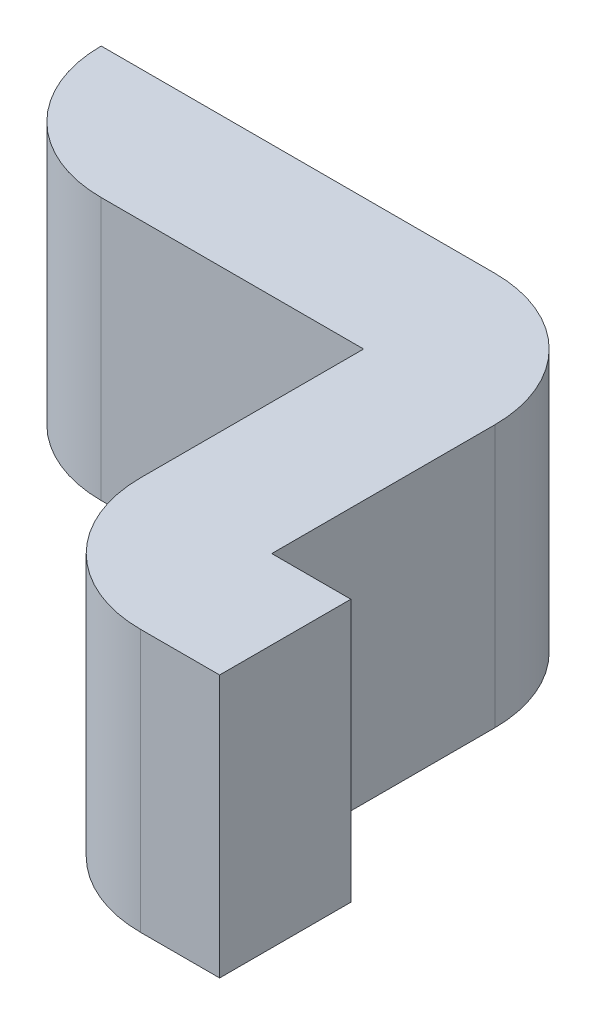
ISO-10303-21;
HEADER;
FILE_DESCRIPTION(('STEP AP214'),'2;1');
FILE_NAME('part.step','',(''),(''),'','','');
FILE_SCHEMA(('AUTOMOTIVE_DESIGN { 1 0 10303 214 1 1 1 1 }'));
ENDSEC;
DATA;
#1=APPLICATION_CONTEXT('core data for automotive mechanical design processes');
#2=APPLICATION_PROTOCOL_DEFINITION('international standard','automotive_design',2000,#1);
#3=PRODUCT_CONTEXT('',#1,'mechanical');
#4=PRODUCT('Part','Part','',(#3));
#5=PRODUCT_RELATED_PRODUCT_CATEGORY('part','',(#4));
#6=PRODUCT_DEFINITION_FORMATION('','',#4);
#7=PRODUCT_DEFINITION_CONTEXT('part definition',#1,'design');
#8=PRODUCT_DEFINITION('design','',#6,#7);
#9=PRODUCT_DEFINITION_SHAPE('','',#8);
#10=(LENGTH_UNIT() NAMED_UNIT(*) SI_UNIT(.MILLI.,.METRE.));
#11=(NAMED_UNIT(*) PLANE_ANGLE_UNIT() SI_UNIT($,.RADIAN.));
#12=(NAMED_UNIT(*) SI_UNIT($,.STERADIAN.) SOLID_ANGLE_UNIT());
#13=UNCERTAINTY_MEASURE_WITH_UNIT(LENGTH_MEASURE(1.E-05),#10,'distance_accuracy_value','');
#14=(GEOMETRIC_REPRESENTATION_CONTEXT(3) GLOBAL_UNCERTAINTY_ASSIGNED_CONTEXT((#13)) GLOBAL_UNIT_ASSIGNED_CONTEXT((#10,
#11,#12)) REPRESENTATION_CONTEXT('',''));
#15=CARTESIAN_POINT('',(0.,0.,0.));
#16=DIRECTION('',(0.,0.,1.));
#17=DIRECTION('',(1.,0.,0.));
#18=AXIS2_PLACEMENT_3D('',#15,#16,#17);
#19=CARTESIAN_POINT('',(-0.0635,1.2954,0.));
#20=DIRECTION('',(0.,-1.,0.));
#21=DIRECTION('',(0.,0.,-1.));
#22=AXIS2_PLACEMENT_3D('',#19,#20,#21);
#23=PLANE('',#22);
#24=DIRECTION('',(-1.,0.,0.));
#25=VECTOR('',#24,1.);
#26=CARTESIAN_POINT('',(0.0635,1.2954,0.127));
#27=LINE('',#26,#25);
#28=CARTESIAN_POINT('',(0.0635,1.2954,0.127));
#29=VERTEX_POINT('',#28);
#30=CARTESIAN_POINT('',(0.3175,1.2954,0.127));
#31=VERTEX_POINT('',#30);
#32=EDGE_CURVE('E102',#29,#31,#27,.F.);
#33=ORIENTED_EDGE('',*,*,#32,.T.);
#34=DIRECTION('',(0.,0.,-1.));
#35=VECTOR('',#34,1.);
#36=CARTESIAN_POINT('',(0.3175,1.2954,0.127));
#37=LINE('',#36,#35);
#38=CARTESIAN_POINT('',(0.3175,1.2954,0.3429));
#39=VERTEX_POINT('',#38);
#40=EDGE_CURVE('E105',#31,#39,#37,.F.);
#41=ORIENTED_EDGE('',*,*,#40,.T.);
#42=CARTESIAN_POINT('',(0.4445,1.2954,0.3429));
#43=DIRECTION('',(0.,-1.,0.));
#44=DIRECTION('',(0.,0.,-1.));
#45=AXIS2_PLACEMENT_3D('',#42,#43,#44);
#46=CIRCLE('',#45,0.127);
#47=CARTESIAN_POINT('',(0.4445,1.2954,0.4699));
#48=VERTEX_POINT('',#47);
#49=EDGE_CURVE('E117',#48,#39,#46,.T.);
#50=ORIENTED_EDGE('',*,*,#49,.F.);
#51=DIRECTION('',(-1.,0.,0.));
#52=VECTOR('',#51,1.);
#53=CARTESIAN_POINT('',(0.4445,1.2954,0.4699));
#54=LINE('',#53,#52);
#55=CARTESIAN_POINT('',(0.521041119299,1.2954,0.4699));
#56=VERTEX_POINT('',#55);
#57=EDGE_CURVE('E134',#48,#56,#54,.F.);
#58=ORIENTED_EDGE('',*,*,#57,.T.);
#59=DIRECTION('',(0.,0.,1.));
#60=VECTOR('',#59,1.);
#61=CARTESIAN_POINT('',(0.521041119299,1.2954,0.4699));
#62=LINE('',#61,#60);
#63=CARTESIAN_POINT('',(0.521041119299,1.2954,0.3429));
#64=VERTEX_POINT('',#63);
#65=EDGE_CURVE('E90',#56,#64,#62,.F.);
#66=ORIENTED_EDGE('',*,*,#65,.T.);
#67=DIRECTION('',(1.,0.,0.));
#68=VECTOR('',#67,1.);
#69=CARTESIAN_POINT('',(0.521041119299,1.2954,0.3429));
#70=LINE('',#69,#68);
#71=CARTESIAN_POINT('',(0.4445,1.2954,0.3429));
#72=VERTEX_POINT('',#71);
#73=EDGE_CURVE('E87',#64,#72,#70,.F.);
#74=ORIENTED_EDGE('',*,*,#73,.T.);
#75=DIRECTION('',(0.,0.,1.));
#76=VECTOR('',#75,1.);
#77=CARTESIAN_POINT('',(0.4445,1.2954,0.3429));
#78=LINE('',#77,#76);
#79=CARTESIAN_POINT('',(0.4445,1.2954,0.127));
#80=VERTEX_POINT('',#79);
#81=EDGE_CURVE('E82',#72,#80,#78,.F.);
#82=ORIENTED_EDGE('',*,*,#81,.T.);
#83=CARTESIAN_POINT('',(0.3175,1.2954,0.127));
#84=DIRECTION('',(0.,-1.,0.));
#85=DIRECTION('',(0.,0.,-1.));
#86=AXIS2_PLACEMENT_3D('',#83,#84,#85);
#87=CIRCLE('',#86,0.127);
#88=CARTESIAN_POINT('',(0.3175,1.2954,0.));
#89=VERTEX_POINT('',#88);
#90=EDGE_CURVE('E20',#89,#80,#87,.T.);
#91=ORIENTED_EDGE('',*,*,#90,.F.);
#92=DIRECTION('',(1.,0.,0.));
#93=VECTOR('',#92,1.);
#94=CARTESIAN_POINT('',(0.3175,1.2954,0.));
#95=LINE('',#94,#93);
#96=CARTESIAN_POINT('',(-0.0635,1.2954,0.));
#97=VERTEX_POINT('',#96);
#98=EDGE_CURVE('E76',#89,#97,#95,.F.);
#99=ORIENTED_EDGE('',*,*,#98,.T.);
#100=CARTESIAN_POINT('',(0.0635,1.2954,0.));
#101=DIRECTION('',(0.,-1.,0.));
#102=DIRECTION('',(0.,0.,-1.));
#103=AXIS2_PLACEMENT_3D('',#100,#101,#102);
#104=CIRCLE('',#103,0.127);
#105=EDGE_CURVE('E108',#29,#97,#104,.T.);
#106=ORIENTED_EDGE('',*,*,#105,.F.);
#107=EDGE_LOOP('',(#33,#41,#50,#58,#66,#74,#82,#91,#99,#106));
#108=FACE_BOUND('',#107,.T.);
#109=ADVANCED_FACE('F17',(#108),#23,.F.);
#110=CARTESIAN_POINT('',(0.3175,1.0414,0.));
#111=DIRECTION('',(0.,0.,1.));
#112=DIRECTION('',(1.,0.,0.));
#113=AXIS2_PLACEMENT_3D('',#110,#111,#112);
#114=PLANE('',#113);
#115=DIRECTION('',(0.,-1.,0.));
#116=VECTOR('',#115,1.);
#117=CARTESIAN_POINT('',(-0.0635,1.0414,0.));
#118=LINE('',#117,#116);
#119=CARTESIAN_POINT('',(-0.0635,1.0414,0.));
#120=VERTEX_POINT('',#119);
#121=EDGE_CURVE('E187',#97,#120,#118,.T.);
#122=ORIENTED_EDGE('',*,*,#121,.F.);
#123=ORIENTED_EDGE('',*,*,#98,.F.);
#124=DIRECTION('',(0.,-1.,0.));
#125=VECTOR('',#124,1.);
#126=CARTESIAN_POINT('',(0.3175,1.0414,0.));
#127=LINE('',#126,#125);
#128=CARTESIAN_POINT('',(0.3175,1.0414,0.));
#129=VERTEX_POINT('',#128);
#130=EDGE_CURVE('E159',#129,#89,#127,.F.);
#131=ORIENTED_EDGE('',*,*,#130,.F.);
#132=DIRECTION('',(1.,0.,0.));
#133=VECTOR('',#132,1.);
#134=CARTESIAN_POINT('',(-0.0635,1.0414,0.));
#135=LINE('',#134,#133);
#136=EDGE_CURVE('E186',#120,#129,#135,.T.);
#137=ORIENTED_EDGE('',*,*,#136,.F.);
#138=EDGE_LOOP('',(#122,#123,#131,#137));
#139=FACE_BOUND('',#138,.T.);
#140=ADVANCED_FACE('F217',(#139),#114,.F.);
#141=CARTESIAN_POINT('',(0.3175,1.0414,0.127));
#142=DIRECTION('',(0.,-1.,0.));
#143=DIRECTION('',(0.,0.,-1.));
#144=AXIS2_PLACEMENT_3D('',#141,#142,#143);
#145=CYLINDRICAL_SURFACE('',#144,0.127);
#146=ORIENTED_EDGE('',*,*,#90,.T.);
#147=DIRECTION('',(0.,1.,0.));
#148=VECTOR('',#147,1.);
#149=CARTESIAN_POINT('',(0.4445,1.0414,0.127));
#150=LINE('',#149,#148);
#151=CARTESIAN_POINT('',(0.4445,1.0414,0.127));
#152=VERTEX_POINT('',#151);
#153=EDGE_CURVE('E157',#80,#152,#150,.F.);
#154=ORIENTED_EDGE('',*,*,#153,.T.);
#155=CARTESIAN_POINT('',(0.3175,1.0414,0.127));
#156=DIRECTION('',(0.,-1.,0.));
#157=DIRECTION('',(0.,0.,-1.));
#158=AXIS2_PLACEMENT_3D('',#155,#156,#157);
#159=CIRCLE('',#158,0.127);
#160=EDGE_CURVE('E183',#129,#152,#159,.T.);
#161=ORIENTED_EDGE('',*,*,#160,.F.);
#162=ORIENTED_EDGE('',*,*,#130,.T.);
#163=EDGE_LOOP('',(#146,#154,#161,#162));
#164=FACE_BOUND('',#163,.T.);
#165=ADVANCED_FACE('F214',(#164),#145,.T.);
#166=CARTESIAN_POINT('',(0.4445,1.0414,0.3429));
#167=DIRECTION('',(-1.,0.,0.));
#168=DIRECTION('',(0.,0.,1.));
#169=AXIS2_PLACEMENT_3D('',#166,#167,#168);
#170=PLANE('',#169);
#171=ORIENTED_EDGE('',*,*,#153,.F.);
#172=ORIENTED_EDGE('',*,*,#81,.F.);
#173=DIRECTION('',(0.,1.,0.));
#174=VECTOR('',#173,1.);
#175=CARTESIAN_POINT('',(0.4445,1.0414,0.3429));
#176=LINE('',#175,#174);
#177=CARTESIAN_POINT('',(0.4445,1.0414,0.3429));
#178=VERTEX_POINT('',#177);
#179=EDGE_CURVE('E153',#72,#178,#176,.F.);
#180=ORIENTED_EDGE('',*,*,#179,.T.);
#181=DIRECTION('',(0.,0.,-1.));
#182=VECTOR('',#181,1.);
#183=CARTESIAN_POINT('',(0.4445,1.0414,0.));
#184=LINE('',#183,#182);
#185=EDGE_CURVE('E150',#152,#178,#184,.F.);
#186=ORIENTED_EDGE('',*,*,#185,.F.);
#187=EDGE_LOOP('',(#171,#172,#180,#186));
#188=FACE_BOUND('',#187,.T.);
#189=ADVANCED_FACE('F211',(#188),#170,.F.);
#190=CARTESIAN_POINT('',(0.521041119299,1.0414,0.3429));
#191=DIRECTION('',(0.,0.,1.));
#192=DIRECTION('',(1.,0.,0.));
#193=AXIS2_PLACEMENT_3D('',#190,#191,#192);
#194=PLANE('',#193);
#195=ORIENTED_EDGE('',*,*,#179,.F.);
#196=ORIENTED_EDGE('',*,*,#73,.F.);
#197=DIRECTION('',(0.,1.,0.));
#198=VECTOR('',#197,1.);
#199=CARTESIAN_POINT('',(0.521041119299,1.0414,0.3429));
#200=LINE('',#199,#198);
#201=CARTESIAN_POINT('',(0.521041119299,1.0414,0.3429));
#202=VERTEX_POINT('',#201);
#203=EDGE_CURVE('E144',#64,#202,#200,.F.);
#204=ORIENTED_EDGE('',*,*,#203,.T.);
#205=DIRECTION('',(1.,0.,0.));
#206=VECTOR('',#205,1.);
#207=CARTESIAN_POINT('',(-0.0635,1.0414,0.3429));
#208=LINE('',#207,#206);
#209=EDGE_CURVE('E141',#178,#202,#208,.T.);
#210=ORIENTED_EDGE('',*,*,#209,.F.);
#211=EDGE_LOOP('',(#195,#196,#204,#210));
#212=FACE_BOUND('',#211,.T.);
#213=ADVANCED_FACE('F208',(#212),#194,.F.);
#214=CARTESIAN_POINT('',(0.521041119299,1.0414,0.4699));
#215=DIRECTION('',(-1.,0.,0.));
#216=DIRECTION('',(0.,0.,1.));
#217=AXIS2_PLACEMENT_3D('',#214,#215,#216);
#218=PLANE('',#217);
#219=ORIENTED_EDGE('',*,*,#203,.F.);
#220=ORIENTED_EDGE('',*,*,#65,.F.);
#221=DIRECTION('',(0.,1.,0.));
#222=VECTOR('',#221,1.);
#223=CARTESIAN_POINT('',(0.521041119299,1.0414,0.4699));
#224=LINE('',#223,#222);
#225=CARTESIAN_POINT('',(0.521041119299,1.0414,0.4699));
#226=VERTEX_POINT('',#225);
#227=EDGE_CURVE('E132',#56,#226,#224,.F.);
#228=ORIENTED_EDGE('',*,*,#227,.T.);
#229=DIRECTION('',(0.,0.,-1.));
#230=VECTOR('',#229,1.);
#231=CARTESIAN_POINT('',(0.521041119299,1.0414,0.));
#232=LINE('',#231,#230);
#233=EDGE_CURVE('E137',#202,#226,#232,.F.);
#234=ORIENTED_EDGE('',*,*,#233,.F.);
#235=EDGE_LOOP('',(#219,#220,#228,#234));
#236=FACE_BOUND('',#235,.T.);
#237=ADVANCED_FACE('F195',(#236),#218,.F.);
#238=CARTESIAN_POINT('',(0.4445,1.0414,0.4699));
#239=DIRECTION('',(0.,0.,-1.));
#240=DIRECTION('',(-1.,0.,0.));
#241=AXIS2_PLACEMENT_3D('',#238,#239,#240);
#242=PLANE('',#241);
#243=ORIENTED_EDGE('',*,*,#227,.F.);
#244=ORIENTED_EDGE('',*,*,#57,.F.);
#245=DIRECTION('',(0.,-1.,0.));
#246=VECTOR('',#245,1.);
#247=CARTESIAN_POINT('',(0.4445,1.0414,0.4699));
#248=LINE('',#247,#246);
#249=CARTESIAN_POINT('',(0.4445,1.0414,0.4699));
#250=VERTEX_POINT('',#249);
#251=EDGE_CURVE('E129',#250,#48,#248,.F.);
#252=ORIENTED_EDGE('',*,*,#251,.F.);
#253=DIRECTION('',(1.,0.,0.));
#254=VECTOR('',#253,1.);
#255=CARTESIAN_POINT('',(-0.0635,1.0414,0.4699));
#256=LINE('',#255,#254);
#257=EDGE_CURVE('E140',#226,#250,#256,.F.);
#258=ORIENTED_EDGE('',*,*,#257,.F.);
#259=EDGE_LOOP('',(#243,#244,#252,#258));
#260=FACE_BOUND('',#259,.T.);
#261=ADVANCED_FACE('F198',(#260),#242,.F.);
#262=CARTESIAN_POINT('',(0.4445,1.0414,0.3429));
#263=DIRECTION('',(0.,-1.,0.));
#264=DIRECTION('',(0.,0.,-1.));
#265=AXIS2_PLACEMENT_3D('',#262,#263,#264);
#266=CYLINDRICAL_SURFACE('',#265,0.127);
#267=ORIENTED_EDGE('',*,*,#49,.T.);
#268=DIRECTION('',(0.,1.,0.));
#269=VECTOR('',#268,1.);
#270=CARTESIAN_POINT('',(0.3175,1.0414,0.3429));
#271=LINE('',#270,#269);
#272=CARTESIAN_POINT('',(0.3175,1.0414,0.3429));
#273=VERTEX_POINT('',#272);
#274=EDGE_CURVE('E111',#39,#273,#271,.F.);
#275=ORIENTED_EDGE('',*,*,#274,.T.);
#276=CARTESIAN_POINT('',(0.4445,1.0414,0.3429));
#277=DIRECTION('',(0.,-1.,0.));
#278=DIRECTION('',(0.,0.,-1.));
#279=AXIS2_PLACEMENT_3D('',#276,#277,#278);
#280=CIRCLE('',#279,0.127);
#281=EDGE_CURVE('E179',#250,#273,#280,.T.);
#282=ORIENTED_EDGE('',*,*,#281,.F.);
#283=ORIENTED_EDGE('',*,*,#251,.T.);
#284=EDGE_LOOP('',(#267,#275,#282,#283));
#285=FACE_BOUND('',#284,.T.);
#286=ADVANCED_FACE('F189',(#285),#266,.T.);
#287=CARTESIAN_POINT('',(0.3175,1.0414,0.127));
#288=DIRECTION('',(1.,0.,0.));
#289=DIRECTION('',(0.,0.,-1.));
#290=AXIS2_PLACEMENT_3D('',#287,#288,#289);
#291=PLANE('',#290);
#292=ORIENTED_EDGE('',*,*,#274,.F.);
#293=ORIENTED_EDGE('',*,*,#40,.F.);
#294=DIRECTION('',(0.,1.,0.));
#295=VECTOR('',#294,1.);
#296=CARTESIAN_POINT('',(0.3175,1.0414,0.127));
#297=LINE('',#296,#295);
#298=CARTESIAN_POINT('',(0.3175,1.0414,0.127));
#299=VERTEX_POINT('',#298);
#300=EDGE_CURVE('E110',#31,#299,#297,.F.);
#301=ORIENTED_EDGE('',*,*,#300,.T.);
#302=DIRECTION('',(0.,0.,-1.));
#303=VECTOR('',#302,1.);
#304=CARTESIAN_POINT('',(0.3175,1.0414,0.));
#305=LINE('',#304,#303);
#306=EDGE_CURVE('E182',#273,#299,#305,.T.);
#307=ORIENTED_EDGE('',*,*,#306,.F.);
#308=EDGE_LOOP('',(#292,#293,#301,#307));
#309=FACE_BOUND('',#308,.T.);
#310=ADVANCED_FACE('F115',(#309),#291,.F.);
#311=CARTESIAN_POINT('',(0.0635,1.0414,0.127));
#312=DIRECTION('',(0.,0.,-1.));
#313=DIRECTION('',(-1.,0.,0.));
#314=AXIS2_PLACEMENT_3D('',#311,#312,#313);
#315=PLANE('',#314);
#316=ORIENTED_EDGE('',*,*,#300,.F.);
#317=ORIENTED_EDGE('',*,*,#32,.F.);
#318=DIRECTION('',(0.,-1.,0.));
#319=VECTOR('',#318,1.);
#320=CARTESIAN_POINT('',(0.0635,1.0414,0.127));
#321=LINE('',#320,#319);
#322=CARTESIAN_POINT('',(0.0635,1.0414,0.127));
#323=VERTEX_POINT('',#322);
#324=EDGE_CURVE('E35',#323,#29,#321,.F.);
#325=ORIENTED_EDGE('',*,*,#324,.F.);
#326=DIRECTION('',(1.,0.,0.));
#327=VECTOR('',#326,1.);
#328=CARTESIAN_POINT('',(-0.0635,1.0414,0.127));
#329=LINE('',#328,#327);
#330=EDGE_CURVE('E26',#299,#323,#329,.F.);
#331=ORIENTED_EDGE('',*,*,#330,.F.);
#332=EDGE_LOOP('',(#316,#317,#325,#331));
#333=FACE_BOUND('',#332,.T.);
#334=ADVANCED_FACE('F119',(#333),#315,.F.);
#335=CARTESIAN_POINT('',(0.0635,1.0414,0.));
#336=DIRECTION('',(0.,-1.,0.));
#337=DIRECTION('',(0.,0.,-1.));
#338=AXIS2_PLACEMENT_3D('',#335,#336,#337);
#339=CYLINDRICAL_SURFACE('',#338,0.127);
#340=ORIENTED_EDGE('',*,*,#105,.T.);
#341=ORIENTED_EDGE('',*,*,#121,.T.);
#342=CARTESIAN_POINT('',(0.0635,1.0414,0.));
#343=DIRECTION('',(0.,-1.,0.));
#344=DIRECTION('',(0.,0.,-1.));
#345=AXIS2_PLACEMENT_3D('',#342,#343,#344);
#346=CIRCLE('',#345,0.127);
#347=EDGE_CURVE('E11',#323,#120,#346,.T.);
#348=ORIENTED_EDGE('',*,*,#347,.F.);
#349=ORIENTED_EDGE('',*,*,#324,.T.);
#350=EDGE_LOOP('',(#340,#341,#348,#349));
#351=FACE_BOUND('',#350,.T.);
#352=ADVANCED_FACE('F219',(#351),#339,.T.);
#353=CARTESIAN_POINT('',(-0.0635,1.0414,0.));
#354=DIRECTION('',(0.,-1.,0.));
#355=DIRECTION('',(0.,0.,-1.));
#356=AXIS2_PLACEMENT_3D('',#353,#354,#355);
#357=PLANE('',#356);
#358=ORIENTED_EDGE('',*,*,#330,.T.);
#359=ORIENTED_EDGE('',*,*,#347,.T.);
#360=ORIENTED_EDGE('',*,*,#136,.T.);
#361=ORIENTED_EDGE('',*,*,#160,.T.);
#362=ORIENTED_EDGE('',*,*,#185,.T.);
#363=ORIENTED_EDGE('',*,*,#209,.T.);
#364=ORIENTED_EDGE('',*,*,#233,.T.);
#365=ORIENTED_EDGE('',*,*,#257,.T.);
#366=ORIENTED_EDGE('',*,*,#281,.T.);
#367=ORIENTED_EDGE('',*,*,#306,.T.);
#368=EDGE_LOOP('',(#358,#359,#360,#361,#362,#363,#364,#365,#366,#367));
#369=FACE_BOUND('',#368,.T.);
#370=ADVANCED_FACE('F202',(#369),#357,.T.);
#371=CLOSED_SHELL('',(#109,#140,#165,#189,#213,#237,#261,#286,#310,#334,#352,#370));
#372=MANIFOLD_SOLID_BREP('B1',#371);
#373=ADVANCED_BREP_SHAPE_REPRESENTATION('',(#18,#372),#14);
#374=SHAPE_DEFINITION_REPRESENTATION(#9,#373);
ENDSEC;
END-ISO-10303-21;
